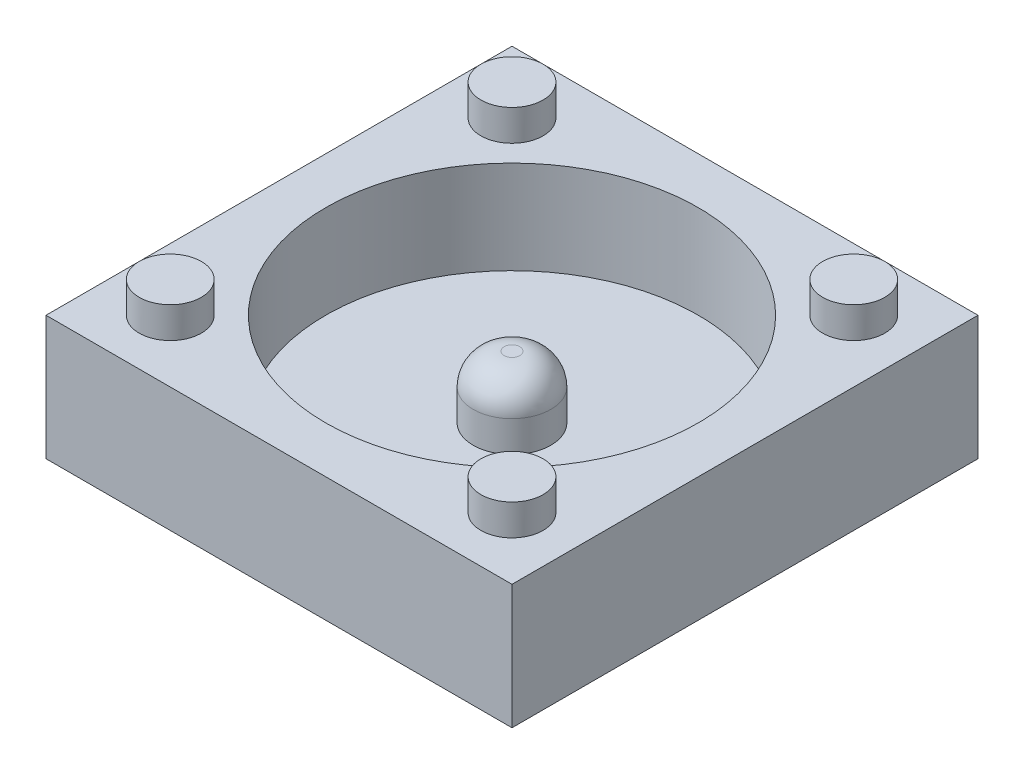
ISO-10303-21;
HEADER;
FILE_DESCRIPTION(('STEP AP214'),'2;1');
FILE_NAME('part.step','',(''),(''),'','','');
FILE_SCHEMA(('AUTOMOTIVE_DESIGN { 1 0 10303 214 1 1 1 1 }'));
ENDSEC;
DATA;
#1=APPLICATION_CONTEXT('core data for automotive mechanical design processes');
#2=APPLICATION_PROTOCOL_DEFINITION('international standard','automotive_design',2000,#1);
#3=PRODUCT_CONTEXT('',#1,'mechanical');
#4=PRODUCT('Part','Part','',(#3));
#5=PRODUCT_RELATED_PRODUCT_CATEGORY('part','',(#4));
#6=PRODUCT_DEFINITION_FORMATION('','',#4);
#7=PRODUCT_DEFINITION_CONTEXT('part definition',#1,'design');
#8=PRODUCT_DEFINITION('design','',#6,#7);
#9=PRODUCT_DEFINITION_SHAPE('','',#8);
#10=(LENGTH_UNIT() NAMED_UNIT(*) SI_UNIT(.MILLI.,.METRE.));
#11=(NAMED_UNIT(*) PLANE_ANGLE_UNIT() SI_UNIT($,.RADIAN.));
#12=(NAMED_UNIT(*) SI_UNIT($,.STERADIAN.) SOLID_ANGLE_UNIT());
#13=UNCERTAINTY_MEASURE_WITH_UNIT(LENGTH_MEASURE(1.E-05),#10,'distance_accuracy_value','');
#14=(GEOMETRIC_REPRESENTATION_CONTEXT(3) GLOBAL_UNCERTAINTY_ASSIGNED_CONTEXT((#13)) GLOBAL_UNIT_ASSIGNED_CONTEXT((#10,
#11,#12)) REPRESENTATION_CONTEXT('',''));
#15=CARTESIAN_POINT('',(0.,0.,0.));
#16=DIRECTION('',(0.,0.,1.));
#17=DIRECTION('',(1.,0.,0.));
#18=AXIS2_PLACEMENT_3D('',#15,#16,#17);
#19=CARTESIAN_POINT('',(7.5,4.,7.5));
#20=DIRECTION('',(-1.,0.,0.));
#21=DIRECTION('',(0.,0.,1.));
#22=AXIS2_PLACEMENT_3D('',#19,#20,#21);
#23=PLANE('',#22);
#24=DIRECTION('',(0.,0.,-1.));
#25=VECTOR('',#24,1.);
#26=CARTESIAN_POINT('',(7.5,0.,7.5));
#27=LINE('',#26,#25);
#28=CARTESIAN_POINT('',(7.5,0.,7.5));
#29=VERTEX_POINT('',#28);
#30=CARTESIAN_POINT('',(7.5,0.,-7.5));
#31=VERTEX_POINT('',#30);
#32=EDGE_CURVE('E101',#29,#31,#27,.T.);
#33=ORIENTED_EDGE('',*,*,#32,.T.);
#34=DIRECTION('',(0.,-1.,0.));
#35=VECTOR('',#34,1.);
#36=CARTESIAN_POINT('',(7.5,4.,-7.5));
#37=LINE('',#36,#35);
#38=CARTESIAN_POINT('',(7.5,4.,-7.5));
#39=VERTEX_POINT('',#38);
#40=EDGE_CURVE('E92',#39,#31,#37,.T.);
#41=ORIENTED_EDGE('',*,*,#40,.F.);
#42=DIRECTION('',(0.,0.,-1.));
#43=VECTOR('',#42,1.);
#44=CARTESIAN_POINT('',(7.5,4.,7.5));
#45=LINE('',#44,#43);
#46=CARTESIAN_POINT('',(7.5,4.,7.5));
#47=VERTEX_POINT('',#46);
#48=EDGE_CURVE('E86',#47,#39,#45,.T.);
#49=ORIENTED_EDGE('',*,*,#48,.F.);
#50=DIRECTION('',(0.,-1.,0.));
#51=VECTOR('',#50,1.);
#52=CARTESIAN_POINT('',(7.5,4.,7.5));
#53=LINE('',#52,#51);
#54=EDGE_CURVE('E97',#47,#29,#53,.T.);
#55=ORIENTED_EDGE('',*,*,#54,.T.);
#56=EDGE_LOOP('',(#33,#41,#49,#55));
#57=FACE_BOUND('',#56,.T.);
#58=ADVANCED_FACE('F33',(#57),#23,.F.);
#59=CARTESIAN_POINT('',(-7.5,4.,-7.5));
#60=DIRECTION('',(0.,0.,1.));
#61=DIRECTION('',(1.,0.,0.));
#62=AXIS2_PLACEMENT_3D('',#59,#60,#61);
#63=PLANE('',#62);
#64=DIRECTION('',(-1.,0.,0.));
#65=VECTOR('',#64,1.);
#66=CARTESIAN_POINT('',(-7.5,0.,-7.5));
#67=LINE('',#66,#65);
#68=CARTESIAN_POINT('',(-7.5,0.,-7.5));
#69=VERTEX_POINT('',#68);
#70=EDGE_CURVE('E91',#31,#69,#67,.T.);
#71=ORIENTED_EDGE('',*,*,#70,.T.);
#72=DIRECTION('',(0.,-1.,0.));
#73=VECTOR('',#72,1.);
#74=CARTESIAN_POINT('',(-7.5,4.,-7.5));
#75=LINE('',#74,#73);
#76=CARTESIAN_POINT('',(-7.5,4.,-7.5));
#77=VERTEX_POINT('',#76);
#78=EDGE_CURVE('E89',#77,#69,#75,.T.);
#79=ORIENTED_EDGE('',*,*,#78,.F.);
#80=DIRECTION('',(-1.,0.,0.));
#81=VECTOR('',#80,1.);
#82=CARTESIAN_POINT('',(-7.5,4.,-7.5));
#83=LINE('',#82,#81);
#84=EDGE_CURVE('E81',#39,#77,#83,.T.);
#85=ORIENTED_EDGE('',*,*,#84,.F.);
#86=ORIENTED_EDGE('',*,*,#40,.T.);
#87=EDGE_LOOP('',(#71,#79,#85,#86));
#88=FACE_BOUND('',#87,.T.);
#89=ADVANCED_FACE('F90',(#88),#63,.F.);
#90=CARTESIAN_POINT('',(-7.5,4.,7.5));
#91=DIRECTION('',(1.,0.,0.));
#92=DIRECTION('',(0.,0.,-1.));
#93=AXIS2_PLACEMENT_3D('',#90,#91,#92);
#94=PLANE('',#93);
#95=DIRECTION('',(0.,0.,1.));
#96=VECTOR('',#95,1.);
#97=CARTESIAN_POINT('',(-7.5,0.,7.5));
#98=LINE('',#97,#96);
#99=CARTESIAN_POINT('',(-7.5,0.,7.5));
#100=VERTEX_POINT('',#99);
#101=EDGE_CURVE('E67',#69,#100,#98,.T.);
#102=ORIENTED_EDGE('',*,*,#101,.T.);
#103=DIRECTION('',(0.,-1.,0.));
#104=VECTOR('',#103,1.);
#105=CARTESIAN_POINT('',(-7.5,4.,7.5));
#106=LINE('',#105,#104);
#107=CARTESIAN_POINT('',(-7.5,4.,7.5));
#108=VERTEX_POINT('',#107);
#109=EDGE_CURVE('E93',#108,#100,#106,.T.);
#110=ORIENTED_EDGE('',*,*,#109,.F.);
#111=DIRECTION('',(0.,0.,1.));
#112=VECTOR('',#111,1.);
#113=CARTESIAN_POINT('',(-7.5,4.,7.5));
#114=LINE('',#113,#112);
#115=EDGE_CURVE('E84',#77,#108,#114,.T.);
#116=ORIENTED_EDGE('',*,*,#115,.F.);
#117=ORIENTED_EDGE('',*,*,#78,.T.);
#118=EDGE_LOOP('',(#102,#110,#116,#117));
#119=FACE_BOUND('',#118,.T.);
#120=ADVANCED_FACE('F95',(#119),#94,.F.);
#121=CARTESIAN_POINT('',(-7.5,4.,7.5));
#122=DIRECTION('',(0.,0.,-1.));
#123=DIRECTION('',(-1.,0.,0.));
#124=AXIS2_PLACEMENT_3D('',#121,#122,#123);
#125=PLANE('',#124);
#126=DIRECTION('',(1.,0.,0.));
#127=VECTOR('',#126,1.);
#128=CARTESIAN_POINT('',(-7.5,0.,7.5));
#129=LINE('',#128,#127);
#130=EDGE_CURVE('E73',#100,#29,#129,.T.);
#131=ORIENTED_EDGE('',*,*,#130,.T.);
#132=ORIENTED_EDGE('',*,*,#54,.F.);
#133=DIRECTION('',(1.,0.,0.));
#134=VECTOR('',#133,1.);
#135=CARTESIAN_POINT('',(-7.5,4.,7.5));
#136=LINE('',#135,#134);
#137=EDGE_CURVE('E50',#108,#47,#136,.T.);
#138=ORIENTED_EDGE('',*,*,#137,.F.);
#139=ORIENTED_EDGE('',*,*,#109,.T.);
#140=EDGE_LOOP('',(#131,#132,#138,#139));
#141=FACE_BOUND('',#140,.T.);
#142=ADVANCED_FACE('F130',(#141),#125,.F.);
#143=CARTESIAN_POINT('',(0.,4.,0.));
#144=DIRECTION('',(0.,-1.,0.));
#145=DIRECTION('',(0.,0.,-1.));
#146=AXIS2_PLACEMENT_3D('',#143,#144,#145);
#147=PLANE('',#146);
#148=CARTESIAN_POINT('',(5.5,4.,5.5));
#149=DIRECTION('',(0.,-1.,0.));
#150=DIRECTION('',(0.,0.,-1.));
#151=AXIS2_PLACEMENT_3D('',#148,#149,#150);
#152=CIRCLE('',#151,1.);
#153=CARTESIAN_POINT('',(5.5,4.,4.5));
#154=VERTEX_POINT('',#153);
#155=EDGE_CURVE('E11',#154,#154,#152,.F.);
#156=ORIENTED_EDGE('',*,*,#155,.F.);
#157=EDGE_LOOP('',(#156));
#158=FACE_BOUND('',#157,.T.);
#159=CARTESIAN_POINT('',(-5.5,4.,5.5));
#160=DIRECTION('',(0.,-1.,0.));
#161=DIRECTION('',(0.,0.,-1.));
#162=AXIS2_PLACEMENT_3D('',#159,#160,#161);
#163=CIRCLE('',#162,1.);
#164=CARTESIAN_POINT('',(-5.5,4.,4.5));
#165=VERTEX_POINT('',#164);
#166=EDGE_CURVE('E42',#165,#165,#163,.F.);
#167=ORIENTED_EDGE('',*,*,#166,.F.);
#168=EDGE_LOOP('',(#167));
#169=FACE_BOUND('',#168,.T.);
#170=CARTESIAN_POINT('',(5.5,4.,-5.5));
#171=DIRECTION('',(0.,-1.,0.));
#172=DIRECTION('',(0.,0.,-1.));
#173=AXIS2_PLACEMENT_3D('',#170,#171,#172);
#174=CIRCLE('',#173,1.);
#175=CARTESIAN_POINT('',(5.5,4.,-6.5));
#176=VERTEX_POINT('',#175);
#177=EDGE_CURVE('E120',#176,#176,#174,.F.);
#178=ORIENTED_EDGE('',*,*,#177,.F.);
#179=EDGE_LOOP('',(#178));
#180=FACE_BOUND('',#179,.T.);
#181=CARTESIAN_POINT('',(-5.5,4.,-5.5));
#182=DIRECTION('',(0.,-1.,0.));
#183=DIRECTION('',(0.,0.,-1.));
#184=AXIS2_PLACEMENT_3D('',#181,#182,#183);
#185=CIRCLE('',#184,1.);
#186=CARTESIAN_POINT('',(-5.5,4.,-6.5));
#187=VERTEX_POINT('',#186);
#188=EDGE_CURVE('E117',#187,#187,#185,.F.);
#189=ORIENTED_EDGE('',*,*,#188,.F.);
#190=EDGE_LOOP('',(#189));
#191=FACE_BOUND('',#190,.T.);
#192=CARTESIAN_POINT('',(0.,4.,0.));
#193=DIRECTION('',(0.,1.,0.));
#194=DIRECTION('',(0.,0.,1.));
#195=AXIS2_PLACEMENT_3D('',#192,#193,#194);
#196=CIRCLE('',#195,6.);
#197=CARTESIAN_POINT('',(0.,4.,6.));
#198=VERTEX_POINT('',#197);
#199=EDGE_CURVE('E139',#198,#198,#196,.T.);
#200=ORIENTED_EDGE('',*,*,#199,.F.);
#201=EDGE_LOOP('',(#200));
#202=FACE_BOUND('',#201,.T.);
#203=ORIENTED_EDGE('',*,*,#48,.T.);
#204=ORIENTED_EDGE('',*,*,#84,.T.);
#205=ORIENTED_EDGE('',*,*,#115,.T.);
#206=ORIENTED_EDGE('',*,*,#137,.T.);
#207=EDGE_LOOP('',(#203,#204,#205,#206));
#208=FACE_BOUND('',#207,.T.);
#209=ADVANCED_FACE('F82',(#158,#169,#180,#191,#202,#208),#147,.F.);
#210=CARTESIAN_POINT('',(0.,0.,0.));
#211=DIRECTION('',(0.,-1.,0.));
#212=DIRECTION('',(0.,0.,-1.));
#213=AXIS2_PLACEMENT_3D('',#210,#211,#212);
#214=PLANE('',#213);
#215=ORIENTED_EDGE('',*,*,#32,.F.);
#216=ORIENTED_EDGE('',*,*,#130,.F.);
#217=ORIENTED_EDGE('',*,*,#101,.F.);
#218=ORIENTED_EDGE('',*,*,#70,.F.);
#219=EDGE_LOOP('',(#215,#216,#217,#218));
#220=FACE_BOUND('',#219,.T.);
#221=ADVANCED_FACE('F129',(#220),#214,.T.);
#222=CARTESIAN_POINT('',(0.,1.,0.));
#223=DIRECTION('',(0.,1.,0.));
#224=DIRECTION('',(0.,0.,1.));
#225=AXIS2_PLACEMENT_3D('',#222,#223,#224);
#226=CYLINDRICAL_SURFACE('',#225,6.);
#227=CARTESIAN_POINT('',(0.,1.,0.));
#228=DIRECTION('',(0.,1.,0.));
#229=DIRECTION('',(0.,0.,1.));
#230=AXIS2_PLACEMENT_3D('',#227,#228,#229);
#231=CIRCLE('',#230,6.);
#232=CARTESIAN_POINT('',(0.,1.,6.));
#233=VERTEX_POINT('',#232);
#234=EDGE_CURVE('E104',#233,#233,#231,.T.);
#235=ORIENTED_EDGE('',*,*,#234,.F.);
#236=EDGE_LOOP('',(#235));
#237=FACE_BOUND('',#236,.T.);
#238=ORIENTED_EDGE('',*,*,#199,.T.);
#239=EDGE_LOOP('',(#238));
#240=FACE_BOUND('',#239,.T.);
#241=ADVANCED_FACE('F188',(#237,#240),#226,.F.);
#242=CARTESIAN_POINT('',(0.,1.,0.));
#243=DIRECTION('',(0.,1.,0.));
#244=DIRECTION('',(0.,0.,1.));
#245=AXIS2_PLACEMENT_3D('',#242,#243,#244);
#246=PLANE('',#245);
#247=CARTESIAN_POINT('',(0.,1.,0.));
#248=DIRECTION('',(0.,1.,0.));
#249=DIRECTION('',(0.,0.,1.));
#250=AXIS2_PLACEMENT_3D('',#247,#248,#249);
#251=CIRCLE('',#250,1.25);
#252=CARTESIAN_POINT('',(0.,1.,1.25));
#253=VERTEX_POINT('',#252);
#254=EDGE_CURVE('E141',#253,#253,#251,.T.);
#255=ORIENTED_EDGE('',*,*,#254,.F.);
#256=EDGE_LOOP('',(#255));
#257=FACE_BOUND('',#256,.T.);
#258=ORIENTED_EDGE('',*,*,#234,.T.);
#259=EDGE_LOOP('',(#258));
#260=FACE_BOUND('',#259,.T.);
#261=ADVANCED_FACE('F193',(#257,#260),#246,.T.);
#262=CARTESIAN_POINT('',(0.,3.,0.));
#263=DIRECTION('',(0.,-1.,0.));
#264=DIRECTION('',(0.,0.,-1.));
#265=AXIS2_PLACEMENT_3D('',#262,#263,#264);
#266=CYLINDRICAL_SURFACE('',#265,1.25);
#267=CARTESIAN_POINT('',(0.,2.,0.));
#268=DIRECTION('',(0.,1.,0.));
#269=DIRECTION('',(0.,0.,1.));
#270=AXIS2_PLACEMENT_3D('',#267,#268,#269);
#271=CIRCLE('',#270,1.25);
#272=CARTESIAN_POINT('',(0.,2.,1.25));
#273=VERTEX_POINT('',#272);
#274=EDGE_CURVE('E114',#273,#273,#271,.F.);
#275=ORIENTED_EDGE('',*,*,#274,.T.);
#276=EDGE_LOOP('',(#275));
#277=FACE_BOUND('',#276,.T.);
#278=ORIENTED_EDGE('',*,*,#254,.T.);
#279=EDGE_LOOP('',(#278));
#280=FACE_BOUND('',#279,.T.);
#281=ADVANCED_FACE('F197',(#277,#280),#266,.T.);
#282=CARTESIAN_POINT('',(0.,3.,0.));
#283=DIRECTION('',(0.,1.,0.));
#284=DIRECTION('',(0.,0.,1.));
#285=AXIS2_PLACEMENT_3D('',#282,#283,#284);
#286=PLANE('',#285);
#287=CARTESIAN_POINT('',(0.,3.,0.));
#288=DIRECTION('',(0.,1.,0.));
#289=DIRECTION('',(0.,0.,1.));
#290=AXIS2_PLACEMENT_3D('',#287,#288,#289);
#291=CIRCLE('',#290,0.25);
#292=CARTESIAN_POINT('',(0.,3.,0.25));
#293=VERTEX_POINT('',#292);
#294=EDGE_CURVE('E111',#293,#293,#291,.T.);
#295=ORIENTED_EDGE('',*,*,#294,.T.);
#296=EDGE_LOOP('',(#295));
#297=FACE_BOUND('',#296,.T.);
#298=ADVANCED_FACE('F201',(#297),#286,.T.);
#299=CARTESIAN_POINT('',(0.,2.,0.));
#300=DIRECTION('',(0.,1.,0.));
#301=DIRECTION('',(0.,0.,1.));
#302=AXIS2_PLACEMENT_3D('',#299,#300,#301);
#303=DEGENERATE_TOROIDAL_SURFACE('',#302,0.25,1.,.T.);
#304=ORIENTED_EDGE('',*,*,#274,.F.);
#305=EDGE_LOOP('',(#304));
#306=FACE_BOUND('',#305,.T.);
#307=ORIENTED_EDGE('',*,*,#294,.F.);
#308=EDGE_LOOP('',(#307));
#309=FACE_BOUND('',#308,.T.);
#310=ADVANCED_FACE('F35',(#306,#309),#303,.T.);
#311=CARTESIAN_POINT('',(-5.5,5.,-5.5));
#312=DIRECTION('',(0.,-1.,0.));
#313=DIRECTION('',(0.,0.,-1.));
#314=AXIS2_PLACEMENT_3D('',#311,#312,#313);
#315=CYLINDRICAL_SURFACE('',#314,1.);
#316=CARTESIAN_POINT('',(-5.5,5.,-5.5));
#317=DIRECTION('',(0.,1.,0.));
#318=DIRECTION('',(0.,0.,1.));
#319=AXIS2_PLACEMENT_3D('',#316,#317,#318);
#320=CIRCLE('',#319,1.);
#321=CARTESIAN_POINT('',(-5.5,5.,-4.5));
#322=VERTEX_POINT('',#321);
#323=EDGE_CURVE('E146',#322,#322,#320,.T.);
#324=ORIENTED_EDGE('',*,*,#323,.F.);
#325=EDGE_LOOP('',(#324));
#326=FACE_BOUND('',#325,.T.);
#327=ORIENTED_EDGE('',*,*,#188,.T.);
#328=EDGE_LOOP('',(#327));
#329=FACE_BOUND('',#328,.T.);
#330=ADVANCED_FACE('F206',(#326,#329),#315,.T.);
#331=CARTESIAN_POINT('',(-5.5,5.,-5.5));
#332=DIRECTION('',(0.,1.,0.));
#333=DIRECTION('',(0.,0.,1.));
#334=AXIS2_PLACEMENT_3D('',#331,#332,#333);
#335=PLANE('',#334);
#336=ORIENTED_EDGE('',*,*,#323,.T.);
#337=EDGE_LOOP('',(#336));
#338=FACE_BOUND('',#337,.T.);
#339=ADVANCED_FACE('F209',(#338),#335,.T.);
#340=CARTESIAN_POINT('',(5.5,5.,-5.5));
#341=DIRECTION('',(0.,-1.,0.));
#342=DIRECTION('',(0.,0.,-1.));
#343=AXIS2_PLACEMENT_3D('',#340,#341,#342);
#344=CYLINDRICAL_SURFACE('',#343,1.);
#345=CARTESIAN_POINT('',(5.5,5.,-5.5));
#346=DIRECTION('',(0.,1.,0.));
#347=DIRECTION('',(0.,0.,1.));
#348=AXIS2_PLACEMENT_3D('',#345,#346,#347);
#349=CIRCLE('',#348,1.);
#350=CARTESIAN_POINT('',(5.5,5.,-4.5));
#351=VERTEX_POINT('',#350);
#352=EDGE_CURVE('E151',#351,#351,#349,.T.);
#353=ORIENTED_EDGE('',*,*,#352,.F.);
#354=EDGE_LOOP('',(#353));
#355=FACE_BOUND('',#354,.T.);
#356=ORIENTED_EDGE('',*,*,#177,.T.);
#357=EDGE_LOOP('',(#356));
#358=FACE_BOUND('',#357,.T.);
#359=ADVANCED_FACE('F213',(#355,#358),#344,.T.);
#360=CARTESIAN_POINT('',(5.5,5.,-5.5));
#361=DIRECTION('',(0.,1.,0.));
#362=DIRECTION('',(0.,0.,1.));
#363=AXIS2_PLACEMENT_3D('',#360,#361,#362);
#364=PLANE('',#363);
#365=ORIENTED_EDGE('',*,*,#352,.T.);
#366=EDGE_LOOP('',(#365));
#367=FACE_BOUND('',#366,.T.);
#368=ADVANCED_FACE('F217',(#367),#364,.T.);
#369=CARTESIAN_POINT('',(-5.5,5.,5.5));
#370=DIRECTION('',(0.,-1.,0.));
#371=DIRECTION('',(0.,0.,-1.));
#372=AXIS2_PLACEMENT_3D('',#369,#370,#371);
#373=CYLINDRICAL_SURFACE('',#372,1.);
#374=CARTESIAN_POINT('',(-5.5,5.,5.5));
#375=DIRECTION('',(0.,1.,0.));
#376=DIRECTION('',(0.,0.,1.));
#377=AXIS2_PLACEMENT_3D('',#374,#375,#376);
#378=CIRCLE('',#377,1.);
#379=CARTESIAN_POINT('',(-5.5,5.,6.5));
#380=VERTEX_POINT('',#379);
#381=EDGE_CURVE('E154',#380,#380,#378,.T.);
#382=ORIENTED_EDGE('',*,*,#381,.F.);
#383=EDGE_LOOP('',(#382));
#384=FACE_BOUND('',#383,.T.);
#385=ORIENTED_EDGE('',*,*,#166,.T.);
#386=EDGE_LOOP('',(#385));
#387=FACE_BOUND('',#386,.T.);
#388=ADVANCED_FACE('F125',(#384,#387),#373,.T.);
#389=CARTESIAN_POINT('',(-5.5,5.,5.5));
#390=DIRECTION('',(0.,1.,0.));
#391=DIRECTION('',(0.,0.,1.));
#392=AXIS2_PLACEMENT_3D('',#389,#390,#391);
#393=PLANE('',#392);
#394=ORIENTED_EDGE('',*,*,#381,.T.);
#395=EDGE_LOOP('',(#394));
#396=FACE_BOUND('',#395,.T.);
#397=ADVANCED_FACE('F166',(#396),#393,.T.);
#398=CARTESIAN_POINT('',(5.5,5.,5.5));
#399=DIRECTION('',(0.,-1.,0.));
#400=DIRECTION('',(0.,0.,-1.));
#401=AXIS2_PLACEMENT_3D('',#398,#399,#400);
#402=CYLINDRICAL_SURFACE('',#401,1.);
#403=CARTESIAN_POINT('',(5.5,5.,5.5));
#404=DIRECTION('',(0.,1.,0.));
#405=DIRECTION('',(0.,0.,1.));
#406=AXIS2_PLACEMENT_3D('',#403,#404,#405);
#407=CIRCLE('',#406,1.);
#408=CARTESIAN_POINT('',(5.5,5.,6.5));
#409=VERTEX_POINT('',#408);
#410=EDGE_CURVE('E157',#409,#409,#407,.T.);
#411=ORIENTED_EDGE('',*,*,#410,.F.);
#412=EDGE_LOOP('',(#411));
#413=FACE_BOUND('',#412,.T.);
#414=ORIENTED_EDGE('',*,*,#155,.T.);
#415=EDGE_LOOP('',(#414));
#416=FACE_BOUND('',#415,.T.);
#417=ADVANCED_FACE('F163',(#413,#416),#402,.T.);
#418=CARTESIAN_POINT('',(5.5,5.,5.5));
#419=DIRECTION('',(0.,1.,0.));
#420=DIRECTION('',(0.,0.,1.));
#421=AXIS2_PLACEMENT_3D('',#418,#419,#420);
#422=PLANE('',#421);
#423=ORIENTED_EDGE('',*,*,#410,.T.);
#424=EDGE_LOOP('',(#423));
#425=FACE_BOUND('',#424,.T.);
#426=ADVANCED_FACE('F161',(#425),#422,.T.);
#427=CLOSED_SHELL('',(#58,#89,#120,#142,#209,#221,#241,#261,#281,#298,#310,#330,#339,#359,#368,
#388,#397,#417,#426));
#428=MANIFOLD_SOLID_BREP('B2',#427);
#429=ADVANCED_BREP_SHAPE_REPRESENTATION('',(#18,#428),#14);
#430=SHAPE_DEFINITION_REPRESENTATION(#9,#429);
ENDSEC;
END-ISO-10303-21;
